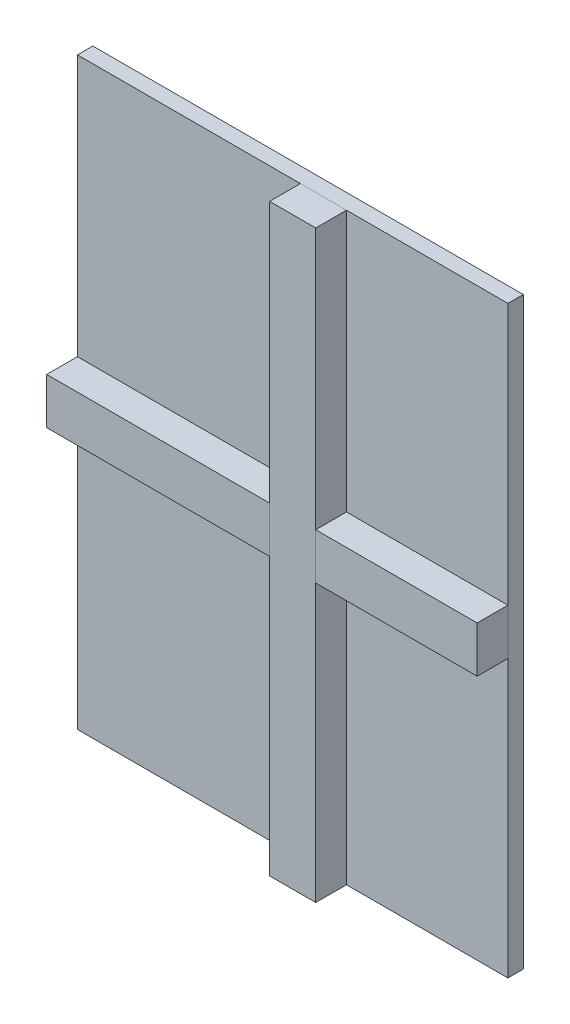
ISO-10303-21;
HEADER;
FILE_DESCRIPTION(('STEP AP214'),'2;1');
FILE_NAME('part.step','',(''),(''),'','','');
FILE_SCHEMA(('AUTOMOTIVE_DESIGN { 1 0 10303 214 1 1 1 1 }'));
ENDSEC;
DATA;
#1=APPLICATION_CONTEXT('core data for automotive mechanical design processes');
#2=APPLICATION_PROTOCOL_DEFINITION('international standard','automotive_design',2000,#1);
#3=PRODUCT_CONTEXT('',#1,'mechanical');
#4=PRODUCT('Part','Part','',(#3));
#5=PRODUCT_RELATED_PRODUCT_CATEGORY('part','',(#4));
#6=PRODUCT_DEFINITION_FORMATION('','',#4);
#7=PRODUCT_DEFINITION_CONTEXT('part definition',#1,'design');
#8=PRODUCT_DEFINITION('design','',#6,#7);
#9=PRODUCT_DEFINITION_SHAPE('','',#8);
#10=(LENGTH_UNIT() NAMED_UNIT(*) SI_UNIT(.MILLI.,.METRE.));
#11=(NAMED_UNIT(*) PLANE_ANGLE_UNIT() SI_UNIT($,.RADIAN.));
#12=(NAMED_UNIT(*) SI_UNIT($,.STERADIAN.) SOLID_ANGLE_UNIT());
#13=UNCERTAINTY_MEASURE_WITH_UNIT(LENGTH_MEASURE(1.E-05),#10,'distance_accuracy_value','');
#14=(GEOMETRIC_REPRESENTATION_CONTEXT(3) GLOBAL_UNCERTAINTY_ASSIGNED_CONTEXT((#13)) GLOBAL_UNIT_ASSIGNED_CONTEXT((#10,
#11,#12)) REPRESENTATION_CONTEXT('',''));
#15=CARTESIAN_POINT('',(0.,0.,0.));
#16=DIRECTION('',(0.,0.,1.));
#17=DIRECTION('',(1.,0.,0.));
#18=AXIS2_PLACEMENT_3D('',#15,#16,#17);
#19=CARTESIAN_POINT('',(-1409.01011152257,2713.07999999987,50.));
#20=DIRECTION('',(0.,1.,0.));
#21=DIRECTION('',(0.,0.,1.));
#22=AXIS2_PLACEMENT_3D('',#19,#20,#21);
#23=PLANE('',#22);
#24=DIRECTION('',(0.,0.,-1.));
#25=VECTOR('',#24,1.);
#26=CARTESIAN_POINT('',(-684.010111522572,2713.07999999987,50.));
#27=LINE('',#26,#25);
#28=CARTESIAN_POINT('',(-684.010111522572,2713.07999999987,150.));
#29=VERTEX_POINT('',#28);
#30=CARTESIAN_POINT('',(-684.010111522572,2713.07999999987,50.));
#31=VERTEX_POINT('',#30);
#32=EDGE_CURVE('E53',#29,#31,#27,.T.);
#33=ORIENTED_EDGE('',*,*,#32,.F.);
#34=DIRECTION('',(-1.,0.,0.));
#35=VECTOR('',#34,1.);
#36=CARTESIAN_POINT('',(-684.010111522572,2713.07999999987,150.));
#37=LINE('',#36,#35);
#38=CARTESIAN_POINT('',(-534.010111522572,2713.07999999987,150.));
#39=VERTEX_POINT('',#38);
#40=EDGE_CURVE('E76',#39,#29,#37,.T.);
#41=ORIENTED_EDGE('',*,*,#40,.F.);
#42=DIRECTION('',(0.,0.,1.));
#43=VECTOR('',#42,1.);
#44=CARTESIAN_POINT('',(-534.010111522572,2713.07999999987,50.));
#45=LINE('',#44,#43);
#46=CARTESIAN_POINT('',(-534.010111522572,2713.07999999987,50.));
#47=VERTEX_POINT('',#46);
#48=EDGE_CURVE('E81',#47,#39,#45,.T.);
#49=ORIENTED_EDGE('',*,*,#48,.F.);
#50=DIRECTION('',(1.,0.,0.));
#51=VECTOR('',#50,1.);
#52=CARTESIAN_POINT('',(-684.010111522572,2713.07999999987,50.));
#53=LINE('',#52,#51);
#54=EDGE_CURVE('E96',#31,#47,#53,.T.);
#55=ORIENTED_EDGE('',*,*,#54,.F.);
#56=EDGE_LOOP('',(#33,#41,#49,#55));
#57=FACE_BOUND('',#56,.T.);
#58=ADVANCED_FACE('F45',(#57),#23,.T.);
#59=CARTESIAN_POINT('',(0.,813.079999999867,0.));
#60=DIRECTION('',(0.,1.,0.));
#61=DIRECTION('',(0.,0.,1.));
#62=AXIS2_PLACEMENT_3D('',#59,#60,#61);
#63=PLANE('',#62);
#64=DIRECTION('',(0.,0.,-1.));
#65=VECTOR('',#64,1.);
#66=CARTESIAN_POINT('',(-684.010111522572,813.079999999867,50.));
#67=LINE('',#66,#65);
#68=CARTESIAN_POINT('',(-684.010111522572,813.079999999867,150.));
#69=VERTEX_POINT('',#68);
#70=CARTESIAN_POINT('',(-684.010111522572,813.079999999867,50.));
#71=VERTEX_POINT('',#70);
#72=EDGE_CURVE('E105',#69,#71,#67,.T.);
#73=ORIENTED_EDGE('',*,*,#72,.T.);
#74=DIRECTION('',(1.,0.,0.));
#75=VECTOR('',#74,1.);
#76=CARTESIAN_POINT('',(-684.010111522572,813.079999999867,50.));
#77=LINE('',#76,#75);
#78=CARTESIAN_POINT('',(-534.010111522572,813.079999999867,50.));
#79=VERTEX_POINT('',#78);
#80=EDGE_CURVE('E94',#71,#79,#77,.T.);
#81=ORIENTED_EDGE('',*,*,#80,.T.);
#82=DIRECTION('',(0.,0.,1.));
#83=VECTOR('',#82,1.);
#84=CARTESIAN_POINT('',(-534.010111522572,813.079999999867,50.));
#85=LINE('',#84,#83);
#86=CARTESIAN_POINT('',(-534.010111522572,813.079999999867,150.));
#87=VERTEX_POINT('',#86);
#88=EDGE_CURVE('E97',#79,#87,#85,.T.);
#89=ORIENTED_EDGE('',*,*,#88,.T.);
#90=DIRECTION('',(-1.,0.,0.));
#91=VECTOR('',#90,1.);
#92=CARTESIAN_POINT('',(-684.010111522572,813.079999999867,150.));
#93=LINE('',#92,#91);
#94=EDGE_CURVE('E102',#87,#69,#93,.T.);
#95=ORIENTED_EDGE('',*,*,#94,.T.);
#96=EDGE_LOOP('',(#73,#81,#89,#95));
#97=FACE_BOUND('',#96,.T.);
#98=ADVANCED_FACE('F104',(#97),#63,.F.);
#99=CARTESIAN_POINT('',(-684.010111522572,2893.35756377307,50.));
#100=DIRECTION('',(0.,0.,-1.));
#101=DIRECTION('',(-1.,0.,0.));
#102=AXIS2_PLACEMENT_3D('',#99,#100,#101);
#103=PLANE('',#102);
#104=DIRECTION('',(0.,-1.,0.));
#105=VECTOR('',#104,1.);
#106=CARTESIAN_POINT('',(-684.010111522572,2893.35756377307,50.));
#107=LINE('',#106,#105);
#108=EDGE_CURVE('E12',#31,#71,#107,.T.);
#109=ORIENTED_EDGE('',*,*,#108,.F.);
#110=ORIENTED_EDGE('',*,*,#54,.T.);
#111=DIRECTION('',(0.,-1.,0.));
#112=VECTOR('',#111,1.);
#113=CARTESIAN_POINT('',(-534.010111522572,2893.35756377307,50.));
#114=LINE('',#113,#112);
#115=EDGE_CURVE('E91',#47,#79,#114,.T.);
#116=ORIENTED_EDGE('',*,*,#115,.T.);
#117=ORIENTED_EDGE('',*,*,#80,.F.);
#118=EDGE_LOOP('',(#109,#110,#116,#117));
#119=FACE_BOUND('',#118,.T.);
#120=ADVANCED_FACE('F92',(#119),#103,.T.);
#121=CARTESIAN_POINT('',(-534.010111522572,2893.35756377307,50.));
#122=DIRECTION('',(1.,0.,0.));
#123=DIRECTION('',(0.,0.,-1.));
#124=AXIS2_PLACEMENT_3D('',#121,#122,#123);
#125=PLANE('',#124);
#126=ORIENTED_EDGE('',*,*,#115,.F.);
#127=ORIENTED_EDGE('',*,*,#48,.T.);
#128=DIRECTION('',(0.,-1.,0.));
#129=VECTOR('',#128,1.);
#130=CARTESIAN_POINT('',(-534.010111522572,2893.35756377307,150.));
#131=LINE('',#130,#129);
#132=EDGE_CURVE('E86',#39,#87,#131,.T.);
#133=ORIENTED_EDGE('',*,*,#132,.T.);
#134=ORIENTED_EDGE('',*,*,#88,.F.);
#135=EDGE_LOOP('',(#126,#127,#133,#134));
#136=FACE_BOUND('',#135,.T.);
#137=ADVANCED_FACE('F98',(#136),#125,.T.);
#138=CARTESIAN_POINT('',(-684.010111522572,2893.35756377307,150.));
#139=DIRECTION('',(0.,0.,1.));
#140=DIRECTION('',(1.,0.,0.));
#141=AXIS2_PLACEMENT_3D('',#138,#139,#140);
#142=PLANE('',#141);
#143=ORIENTED_EDGE('',*,*,#132,.F.);
#144=ORIENTED_EDGE('',*,*,#40,.T.);
#145=DIRECTION('',(0.,-1.,0.));
#146=VECTOR('',#145,1.);
#147=CARTESIAN_POINT('',(-684.010111522572,2893.35756377307,150.));
#148=LINE('',#147,#146);
#149=EDGE_CURVE('E112',#29,#69,#148,.T.);
#150=ORIENTED_EDGE('',*,*,#149,.T.);
#151=ORIENTED_EDGE('',*,*,#94,.F.);
#152=EDGE_LOOP('',(#143,#144,#150,#151));
#153=FACE_BOUND('',#152,.T.);
#154=ADVANCED_FACE('F118',(#153),#142,.T.);
#155=CARTESIAN_POINT('',(-684.010111522572,2893.35756377307,50.));
#156=DIRECTION('',(-1.,0.,0.));
#157=DIRECTION('',(0.,0.,1.));
#158=AXIS2_PLACEMENT_3D('',#155,#156,#157);
#159=PLANE('',#158);
#160=ORIENTED_EDGE('',*,*,#149,.F.);
#161=ORIENTED_EDGE('',*,*,#32,.T.);
#162=ORIENTED_EDGE('',*,*,#108,.T.);
#163=ORIENTED_EDGE('',*,*,#72,.F.);
#164=EDGE_LOOP('',(#160,#161,#162,#163));
#165=FACE_BOUND('',#164,.T.);
#166=ADVANCED_FACE('F119',(#165),#159,.T.);
#167=CLOSED_SHELL('',(#58,#98,#120,#137,#154,#166));
#168=MANIFOLD_SOLID_BREP('B2_NOT_SHOWN',#167);
#169=CARTESIAN_POINT('',(-1589.28767529577,1713.07999999987,50.));
#170=DIRECTION('',(0.,0.,-1.));
#171=DIRECTION('',(-1.,0.,0.));
#172=AXIS2_PLACEMENT_3D('',#169,#170,#171);
#173=PLANE('',#172);
#174=DIRECTION('',(0.,-1.,0.));
#175=VECTOR('',#174,1.);
#176=CARTESIAN_POINT('',(-1409.01011152257,1713.07999999987,50.));
#177=LINE('',#176,#175);
#178=CARTESIAN_POINT('',(-1409.01011152257,1863.07999999987,50.));
#179=VERTEX_POINT('',#178);
#180=CARTESIAN_POINT('',(-1409.01011152257,1713.07999999987,50.));
#181=VERTEX_POINT('',#180);
#182=EDGE_CURVE('E185',#179,#181,#177,.T.);
#183=ORIENTED_EDGE('',*,*,#182,.F.);
#184=DIRECTION('',(1.,0.,0.));
#185=VECTOR('',#184,1.);
#186=CARTESIAN_POINT('',(-1589.28767529577,1863.07999999987,50.));
#187=LINE('',#186,#185);
#188=CARTESIAN_POINT('',(-9.01011152257199,1863.07999999987,50.));
#189=VERTEX_POINT('',#188);
#190=EDGE_CURVE('E211',#179,#189,#187,.T.);
#191=ORIENTED_EDGE('',*,*,#190,.T.);
#192=DIRECTION('',(0.,1.,0.));
#193=VECTOR('',#192,1.);
#194=CARTESIAN_POINT('',(-9.01011152257197,1713.07999999987,50.));
#195=LINE('',#194,#193);
#196=CARTESIAN_POINT('',(-9.01011152257197,1713.07999999987,50.));
#197=VERTEX_POINT('',#196);
#198=EDGE_CURVE('E215',#197,#189,#195,.T.);
#199=ORIENTED_EDGE('',*,*,#198,.F.);
#200=DIRECTION('',(1.,0.,0.));
#201=VECTOR('',#200,1.);
#202=CARTESIAN_POINT('',(-1589.28767529577,1713.07999999987,50.));
#203=LINE('',#202,#201);
#204=EDGE_CURVE('E237',#181,#197,#203,.T.);
#205=ORIENTED_EDGE('',*,*,#204,.F.);
#206=EDGE_LOOP('',(#183,#191,#199,#205));
#207=FACE_BOUND('',#206,.T.);
#208=ADVANCED_FACE('F177',(#207),#173,.T.);
#209=CARTESIAN_POINT('',(-1589.28767529577,1713.07999999987,50.));
#210=DIRECTION('',(0.,-1.,0.));
#211=DIRECTION('',(1.,0.,0.));
#212=AXIS2_PLACEMENT_3D('',#209,#210,#211);
#213=PLANE('',#212);
#214=DIRECTION('',(0.,0.,1.));
#215=VECTOR('',#214,1.);
#216=CARTESIAN_POINT('',(-1409.01011152257,1713.07999999987,50.));
#217=LINE('',#216,#215);
#218=CARTESIAN_POINT('',(-1409.01011152257,1713.07999999987,150.));
#219=VERTEX_POINT('',#218);
#220=EDGE_CURVE('E249',#181,#219,#217,.T.);
#221=ORIENTED_EDGE('',*,*,#220,.F.);
#222=ORIENTED_EDGE('',*,*,#204,.T.);
#223=DIRECTION('',(0.,0.,-1.));
#224=VECTOR('',#223,1.);
#225=CARTESIAN_POINT('',(-9.01011152257197,1713.07999999987,50.));
#226=LINE('',#225,#224);
#227=CARTESIAN_POINT('',(-9.01011152257197,1713.07999999987,150.));
#228=VERTEX_POINT('',#227);
#229=EDGE_CURVE('E219',#228,#197,#226,.T.);
#230=ORIENTED_EDGE('',*,*,#229,.F.);
#231=DIRECTION('',(1.,0.,0.));
#232=VECTOR('',#231,1.);
#233=CARTESIAN_POINT('',(-1589.28767529577,1713.07999999987,150.));
#234=LINE('',#233,#232);
#235=EDGE_CURVE('E240',#219,#228,#234,.T.);
#236=ORIENTED_EDGE('',*,*,#235,.F.);
#237=EDGE_LOOP('',(#221,#222,#230,#236));
#238=FACE_BOUND('',#237,.T.);
#239=ADVANCED_FACE('F248',(#238),#213,.T.);
#240=CARTESIAN_POINT('',(-1589.28767529577,1713.07999999987,150.));
#241=DIRECTION('',(0.,0.,1.));
#242=DIRECTION('',(1.,0.,0.));
#243=AXIS2_PLACEMENT_3D('',#240,#241,#242);
#244=PLANE('',#243);
#245=DIRECTION('',(0.,1.,0.));
#246=VECTOR('',#245,1.);
#247=CARTESIAN_POINT('',(-1409.01011152257,1713.07999999987,150.));
#248=LINE('',#247,#246);
#249=CARTESIAN_POINT('',(-1409.01011152257,1863.07999999987,150.));
#250=VERTEX_POINT('',#249);
#251=EDGE_CURVE('E239',#219,#250,#248,.T.);
#252=ORIENTED_EDGE('',*,*,#251,.F.);
#253=ORIENTED_EDGE('',*,*,#235,.T.);
#254=DIRECTION('',(0.,-1.,0.));
#255=VECTOR('',#254,1.);
#256=CARTESIAN_POINT('',(-9.01011152257197,1713.07999999987,150.));
#257=LINE('',#256,#255);
#258=CARTESIAN_POINT('',(-9.01011152257199,1863.07999999987,150.));
#259=VERTEX_POINT('',#258);
#260=EDGE_CURVE('E227',#259,#228,#257,.T.);
#261=ORIENTED_EDGE('',*,*,#260,.F.);
#262=DIRECTION('',(1.,0.,0.));
#263=VECTOR('',#262,1.);
#264=CARTESIAN_POINT('',(-1589.28767529577,1863.07999999987,150.));
#265=LINE('',#264,#263);
#266=EDGE_CURVE('E218',#250,#259,#265,.T.);
#267=ORIENTED_EDGE('',*,*,#266,.F.);
#268=EDGE_LOOP('',(#252,#253,#261,#267));
#269=FACE_BOUND('',#268,.T.);
#270=ADVANCED_FACE('F245',(#269),#244,.T.);
#271=CARTESIAN_POINT('',(-1589.28767529577,1863.07999999987,50.));
#272=DIRECTION('',(0.,1.,0.));
#273=DIRECTION('',(-1.,0.,0.));
#274=AXIS2_PLACEMENT_3D('',#271,#272,#273);
#275=PLANE('',#274);
#276=DIRECTION('',(0.,0.,-1.));
#277=VECTOR('',#276,1.);
#278=CARTESIAN_POINT('',(-1409.01011152257,1863.07999999987,50.));
#279=LINE('',#278,#277);
#280=EDGE_CURVE('E43',#250,#179,#279,.T.);
#281=ORIENTED_EDGE('',*,*,#280,.F.);
#282=ORIENTED_EDGE('',*,*,#266,.T.);
#283=DIRECTION('',(0.,0.,1.));
#284=VECTOR('',#283,1.);
#285=CARTESIAN_POINT('',(-9.01011152257199,1863.07999999987,50.));
#286=LINE('',#285,#284);
#287=EDGE_CURVE('E221',#189,#259,#286,.T.);
#288=ORIENTED_EDGE('',*,*,#287,.F.);
#289=ORIENTED_EDGE('',*,*,#190,.F.);
#290=EDGE_LOOP('',(#281,#282,#288,#289));
#291=FACE_BOUND('',#290,.T.);
#292=ADVANCED_FACE('F222',(#291),#275,.T.);
#293=CARTESIAN_POINT('',(-9.01011152257175,0.,0.));
#294=DIRECTION('',(1.,0.,0.));
#295=DIRECTION('',(0.,1.,0.));
#296=AXIS2_PLACEMENT_3D('',#293,#294,#295);
#297=PLANE('',#296);
#298=ORIENTED_EDGE('',*,*,#198,.T.);
#299=ORIENTED_EDGE('',*,*,#287,.T.);
#300=ORIENTED_EDGE('',*,*,#260,.T.);
#301=ORIENTED_EDGE('',*,*,#229,.T.);
#302=EDGE_LOOP('',(#298,#299,#300,#301));
#303=FACE_BOUND('',#302,.T.);
#304=ADVANCED_FACE('F229',(#303),#297,.T.);
#305=CARTESIAN_POINT('',(-1409.01011152257,2713.07999999987,50.));
#306=DIRECTION('',(1.,0.,0.));
#307=DIRECTION('',(0.,1.,0.));
#308=AXIS2_PLACEMENT_3D('',#305,#306,#307);
#309=PLANE('',#308);
#310=ORIENTED_EDGE('',*,*,#182,.T.);
#311=ORIENTED_EDGE('',*,*,#220,.T.);
#312=ORIENTED_EDGE('',*,*,#251,.T.);
#313=ORIENTED_EDGE('',*,*,#280,.T.);
#314=EDGE_LOOP('',(#310,#311,#312,#313));
#315=FACE_BOUND('',#314,.T.);
#316=ADVANCED_FACE('F250',(#315),#309,.F.);
#317=CLOSED_SHELL('',(#208,#239,#270,#292,#304,#316));
#318=MANIFOLD_SOLID_BREP('B6_NOT_SHOWN',#317);
#319=CARTESIAN_POINT('',(-1409.01011152257,2713.07999999987,50.));
#320=DIRECTION('',(1.,0.,0.));
#321=DIRECTION('',(0.,1.,0.));
#322=AXIS2_PLACEMENT_3D('',#319,#320,#321);
#323=PLANE('',#322);
#324=DIRECTION('',(0.,-1.,0.));
#325=VECTOR('',#324,1.);
#326=CARTESIAN_POINT('',(-1409.01011152257,2713.07999999987,0.));
#327=LINE('',#326,#325);
#328=CARTESIAN_POINT('',(-1409.01011152257,2713.07999999987,0.));
#329=VERTEX_POINT('',#328);
#330=CARTESIAN_POINT('',(-1409.01011152257,813.079999999867,0.));
#331=VERTEX_POINT('',#330);
#332=EDGE_CURVE('E363',#329,#331,#327,.T.);
#333=ORIENTED_EDGE('',*,*,#332,.T.);
#334=DIRECTION('',(0.,0.,-1.));
#335=VECTOR('',#334,1.);
#336=CARTESIAN_POINT('',(-1409.01011152257,813.079999999867,50.));
#337=LINE('',#336,#335);
#338=CARTESIAN_POINT('',(-1409.01011152257,813.079999999867,50.));
#339=VERTEX_POINT('',#338);
#340=EDGE_CURVE('E175',#339,#331,#337,.T.);
#341=ORIENTED_EDGE('',*,*,#340,.F.);
#342=DIRECTION('',(0.,-1.,0.));
#343=VECTOR('',#342,1.);
#344=CARTESIAN_POINT('',(-1409.01011152257,2713.07999999987,50.));
#345=LINE('',#344,#343);
#346=CARTESIAN_POINT('',(-1409.01011152257,2713.07999999987,50.));
#347=VERTEX_POINT('',#346);
#348=EDGE_CURVE('E349',#347,#339,#345,.T.);
#349=ORIENTED_EDGE('',*,*,#348,.F.);
#350=DIRECTION('',(0.,0.,-1.));
#351=VECTOR('',#350,1.);
#352=CARTESIAN_POINT('',(-1409.01011152257,2713.07999999987,50.));
#353=LINE('',#352,#351);
#354=EDGE_CURVE('E316',#347,#329,#353,.T.);
#355=ORIENTED_EDGE('',*,*,#354,.T.);
#356=EDGE_LOOP('',(#333,#341,#349,#355));
#357=FACE_BOUND('',#356,.T.);
#358=ADVANCED_FACE('F300',(#357),#323,.F.);
#359=CARTESIAN_POINT('',(-1409.01011152257,813.079999999867,50.));
#360=DIRECTION('',(0.,1.,0.));
#361=DIRECTION('',(0.,0.,1.));
#362=AXIS2_PLACEMENT_3D('',#359,#360,#361);
#363=PLANE('',#362);
#364=DIRECTION('',(1.,0.,0.));
#365=VECTOR('',#364,1.);
#366=CARTESIAN_POINT('',(-1409.01011152257,813.079999999867,0.));
#367=LINE('',#366,#365);
#368=CARTESIAN_POINT('',(-9.01011152257186,813.079999999867,0.));
#369=VERTEX_POINT('',#368);
#370=EDGE_CURVE('E354',#331,#369,#367,.T.);
#371=ORIENTED_EDGE('',*,*,#370,.T.);
#372=DIRECTION('',(0.,0.,-1.));
#373=VECTOR('',#372,1.);
#374=CARTESIAN_POINT('',(-9.01011152257186,813.079999999867,50.));
#375=LINE('',#374,#373);
#376=CARTESIAN_POINT('',(-9.01011152257186,813.079999999867,50.));
#377=VERTEX_POINT('',#376);
#378=EDGE_CURVE('E308',#377,#369,#375,.T.);
#379=ORIENTED_EDGE('',*,*,#378,.F.);
#380=DIRECTION('',(1.,0.,0.));
#381=VECTOR('',#380,1.);
#382=CARTESIAN_POINT('',(-1409.01011152257,813.079999999867,50.));
#383=LINE('',#382,#381);
#384=EDGE_CURVE('E341',#339,#377,#383,.T.);
#385=ORIENTED_EDGE('',*,*,#384,.F.);
#386=ORIENTED_EDGE('',*,*,#340,.T.);
#387=EDGE_LOOP('',(#371,#379,#385,#386));
#388=FACE_BOUND('',#387,.T.);
#389=ADVANCED_FACE('F353',(#388),#363,.F.);
#390=CARTESIAN_POINT('',(-9.01011152257209,2713.07999999987,50.));
#391=DIRECTION('',(1.,0.,0.));
#392=DIRECTION('',(0.,1.,0.));
#393=AXIS2_PLACEMENT_3D('',#390,#391,#392);
#394=PLANE('',#393);
#395=DIRECTION('',(0.,-1.,0.));
#396=VECTOR('',#395,1.);
#397=CARTESIAN_POINT('',(-9.01011152257209,2713.07999999987,0.));
#398=LINE('',#397,#396);
#399=CARTESIAN_POINT('',(-9.01011152257209,2713.07999999987,0.));
#400=VERTEX_POINT('',#399);
#401=EDGE_CURVE('E366',#400,#369,#398,.T.);
#402=ORIENTED_EDGE('',*,*,#401,.F.);
#403=DIRECTION('',(0.,0.,-1.));
#404=VECTOR('',#403,1.);
#405=CARTESIAN_POINT('',(-9.01011152257209,2713.07999999987,50.));
#406=LINE('',#405,#404);
#407=CARTESIAN_POINT('',(-9.01011152257209,2713.07999999987,50.));
#408=VERTEX_POINT('',#407);
#409=EDGE_CURVE('E330',#408,#400,#406,.T.);
#410=ORIENTED_EDGE('',*,*,#409,.F.);
#411=DIRECTION('',(0.,-1.,0.));
#412=VECTOR('',#411,1.);
#413=CARTESIAN_POINT('',(-9.01011152257209,2713.07999999987,50.));
#414=LINE('',#413,#412);
#415=EDGE_CURVE('E348',#408,#377,#414,.T.);
#416=ORIENTED_EDGE('',*,*,#415,.T.);
#417=ORIENTED_EDGE('',*,*,#378,.T.);
#418=EDGE_LOOP('',(#402,#410,#416,#417));
#419=FACE_BOUND('',#418,.T.);
#420=ADVANCED_FACE('F357',(#419),#394,.T.);
#421=CARTESIAN_POINT('',(-1409.01011152257,2713.07999999987,50.));
#422=DIRECTION('',(0.,1.,0.));
#423=DIRECTION('',(0.,0.,1.));
#424=AXIS2_PLACEMENT_3D('',#421,#422,#423);
#425=PLANE('',#424);
#426=DIRECTION('',(1.,0.,0.));
#427=VECTOR('',#426,1.);
#428=CARTESIAN_POINT('',(-1409.01011152257,2713.07999999987,0.));
#429=LINE('',#428,#427);
#430=EDGE_CURVE('E368',#329,#400,#429,.T.);
#431=ORIENTED_EDGE('',*,*,#430,.F.);
#432=ORIENTED_EDGE('',*,*,#354,.F.);
#433=DIRECTION('',(1.,0.,0.));
#434=VECTOR('',#433,1.);
#435=CARTESIAN_POINT('',(-1409.01011152257,2713.07999999987,50.));
#436=LINE('',#435,#434);
#437=EDGE_CURVE('E358',#347,#408,#436,.T.);
#438=ORIENTED_EDGE('',*,*,#437,.T.);
#439=ORIENTED_EDGE('',*,*,#409,.T.);
#440=EDGE_LOOP('',(#431,#432,#438,#439));
#441=FACE_BOUND('',#440,.T.);
#442=ADVANCED_FACE('F374',(#441),#425,.T.);
#443=CARTESIAN_POINT('',(0.,0.,50.));
#444=DIRECTION('',(0.,0.,1.));
#445=DIRECTION('',(1.,0.,0.));
#446=AXIS2_PLACEMENT_3D('',#443,#444,#445);
#447=PLANE('',#446);
#448=ORIENTED_EDGE('',*,*,#348,.T.);
#449=ORIENTED_EDGE('',*,*,#384,.T.);
#450=ORIENTED_EDGE('',*,*,#415,.F.);
#451=ORIENTED_EDGE('',*,*,#437,.F.);
#452=EDGE_LOOP('',(#448,#449,#450,#451));
#453=FACE_BOUND('',#452,.T.);
#454=ADVANCED_FACE('F345',(#453),#447,.T.);
#455=CARTESIAN_POINT('',(0.,0.,0.));
#456=DIRECTION('',(0.,0.,1.));
#457=DIRECTION('',(1.,0.,0.));
#458=AXIS2_PLACEMENT_3D('',#455,#456,#457);
#459=PLANE('',#458);
#460=ORIENTED_EDGE('',*,*,#332,.F.);
#461=ORIENTED_EDGE('',*,*,#430,.T.);
#462=ORIENTED_EDGE('',*,*,#401,.T.);
#463=ORIENTED_EDGE('',*,*,#370,.F.);
#464=EDGE_LOOP('',(#460,#461,#462,#463));
#465=FACE_BOUND('',#464,.T.);
#466=ADVANCED_FACE('F373',(#465),#459,.F.);
#467=CLOSED_SHELL('',(#358,#389,#420,#442,#454,#466));
#468=MANIFOLD_SOLID_BREP('B37',#467);
#469=ADVANCED_BREP_SHAPE_REPRESENTATION('',(#18,#168,#318,#468),#14);
#470=SHAPE_DEFINITION_REPRESENTATION(#9,#469);
ENDSEC;
END-ISO-10303-21;
